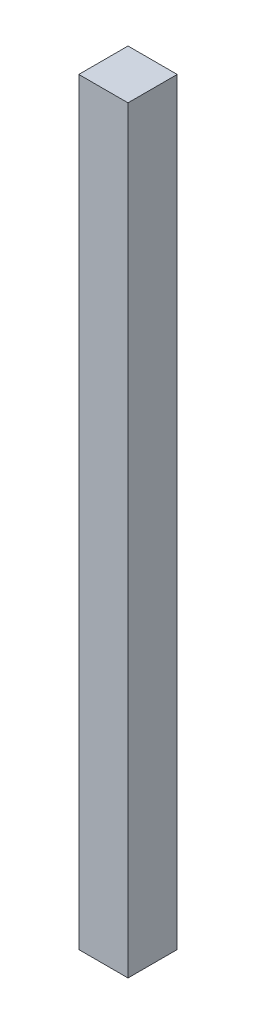
ISO-10303-21;
HEADER;
FILE_DESCRIPTION(('STEP AP214'),'2;1');
FILE_NAME('part.step','',(''),(''),'','','');
FILE_SCHEMA(('AUTOMOTIVE_DESIGN { 1 0 10303 214 1 1 1 1 }'));
ENDSEC;
DATA;
#1=APPLICATION_CONTEXT('core data for automotive mechanical design processes');
#2=APPLICATION_PROTOCOL_DEFINITION('international standard','automotive_design',2000,#1);
#3=PRODUCT_CONTEXT('',#1,'mechanical');
#4=PRODUCT('Part','Part','',(#3));
#5=PRODUCT_RELATED_PRODUCT_CATEGORY('part','',(#4));
#6=PRODUCT_DEFINITION_FORMATION('','',#4);
#7=PRODUCT_DEFINITION_CONTEXT('part definition',#1,'design');
#8=PRODUCT_DEFINITION('design','',#6,#7);
#9=PRODUCT_DEFINITION_SHAPE('','',#8);
#10=(LENGTH_UNIT() NAMED_UNIT(*) SI_UNIT(.MILLI.,.METRE.));
#11=(NAMED_UNIT(*) PLANE_ANGLE_UNIT() SI_UNIT($,.RADIAN.));
#12=(NAMED_UNIT(*) SI_UNIT($,.STERADIAN.) SOLID_ANGLE_UNIT());
#13=UNCERTAINTY_MEASURE_WITH_UNIT(LENGTH_MEASURE(1.E-05),#10,'distance_accuracy_value','');
#14=(GEOMETRIC_REPRESENTATION_CONTEXT(3) GLOBAL_UNCERTAINTY_ASSIGNED_CONTEXT((#13)) GLOBAL_UNIT_ASSIGNED_CONTEXT((#10,
#11,#12)) REPRESENTATION_CONTEXT('',''));
#15=CARTESIAN_POINT('',(0.,0.,0.));
#16=DIRECTION('',(0.,0.,1.));
#17=DIRECTION('',(1.,0.,0.));
#18=AXIS2_PLACEMENT_3D('',#15,#16,#17);
#19=CARTESIAN_POINT('',(-25.,770.,25.));
#20=DIRECTION('',(1.,0.,0.));
#21=DIRECTION('',(0.,0.,-1.));
#22=AXIS2_PLACEMENT_3D('',#19,#20,#21);
#23=PLANE('',#22);
#24=DIRECTION('',(0.,0.,1.));
#25=VECTOR('',#24,1.);
#26=CARTESIAN_POINT('',(-25.,0.,25.));
#27=LINE('',#26,#25);
#28=CARTESIAN_POINT('',(-25.,0.,-25.));
#29=VERTEX_POINT('',#28);
#30=CARTESIAN_POINT('',(-25.,0.,25.));
#31=VERTEX_POINT('',#30);
#32=EDGE_CURVE('E111',#29,#31,#27,.T.);
#33=ORIENTED_EDGE('',*,*,#32,.T.);
#34=DIRECTION('',(0.,-1.,0.));
#35=VECTOR('',#34,1.);
#36=CARTESIAN_POINT('',(-25.,770.,25.));
#37=LINE('',#36,#35);
#38=CARTESIAN_POINT('',(-25.,770.,25.));
#39=VERTEX_POINT('',#38);
#40=EDGE_CURVE('E11',#39,#31,#37,.T.);
#41=ORIENTED_EDGE('',*,*,#40,.F.);
#42=DIRECTION('',(0.,0.,1.));
#43=VECTOR('',#42,1.);
#44=CARTESIAN_POINT('',(-25.,770.,25.));
#45=LINE('',#44,#43);
#46=CARTESIAN_POINT('',(-25.,770.,-25.));
#47=VERTEX_POINT('',#46);
#48=EDGE_CURVE('E95',#47,#39,#45,.T.);
#49=ORIENTED_EDGE('',*,*,#48,.F.);
#50=DIRECTION('',(0.,-1.,0.));
#51=VECTOR('',#50,1.);
#52=CARTESIAN_POINT('',(-25.,770.,-25.));
#53=LINE('',#52,#51);
#54=EDGE_CURVE('E107',#47,#29,#53,.T.);
#55=ORIENTED_EDGE('',*,*,#54,.T.);
#56=EDGE_LOOP('',(#33,#41,#49,#55));
#57=FACE_BOUND('',#56,.T.);
#58=ADVANCED_FACE('F43',(#57),#23,.F.);
#59=CARTESIAN_POINT('',(25.,770.,25.));
#60=DIRECTION('',(0.,0.,-1.));
#61=DIRECTION('',(-1.,0.,0.));
#62=AXIS2_PLACEMENT_3D('',#59,#60,#61);
#63=PLANE('',#62);
#64=DIRECTION('',(1.,0.,0.));
#65=VECTOR('',#64,1.);
#66=CARTESIAN_POINT('',(25.,0.,25.));
#67=LINE('',#66,#65);
#68=CARTESIAN_POINT('',(25.,0.,25.));
#69=VERTEX_POINT('',#68);
#70=EDGE_CURVE('E100',#31,#69,#67,.T.);
#71=ORIENTED_EDGE('',*,*,#70,.T.);
#72=DIRECTION('',(0.,-1.,0.));
#73=VECTOR('',#72,1.);
#74=CARTESIAN_POINT('',(25.,770.,25.));
#75=LINE('',#74,#73);
#76=CARTESIAN_POINT('',(25.,770.,25.));
#77=VERTEX_POINT('',#76);
#78=EDGE_CURVE('E52',#77,#69,#75,.T.);
#79=ORIENTED_EDGE('',*,*,#78,.F.);
#80=DIRECTION('',(1.,0.,0.));
#81=VECTOR('',#80,1.);
#82=CARTESIAN_POINT('',(25.,770.,25.));
#83=LINE('',#82,#81);
#84=EDGE_CURVE('E90',#39,#77,#83,.T.);
#85=ORIENTED_EDGE('',*,*,#84,.F.);
#86=ORIENTED_EDGE('',*,*,#40,.T.);
#87=EDGE_LOOP('',(#71,#79,#85,#86));
#88=FACE_BOUND('',#87,.T.);
#89=ADVANCED_FACE('F99',(#88),#63,.F.);
#90=CARTESIAN_POINT('',(25.,770.,25.));
#91=DIRECTION('',(-1.,0.,0.));
#92=DIRECTION('',(0.,0.,1.));
#93=AXIS2_PLACEMENT_3D('',#90,#91,#92);
#94=PLANE('',#93);
#95=DIRECTION('',(0.,0.,-1.));
#96=VECTOR('',#95,1.);
#97=CARTESIAN_POINT('',(25.,0.,25.));
#98=LINE('',#97,#96);
#99=CARTESIAN_POINT('',(25.,0.,-25.));
#100=VERTEX_POINT('',#99);
#101=EDGE_CURVE('E77',#69,#100,#98,.T.);
#102=ORIENTED_EDGE('',*,*,#101,.T.);
#103=DIRECTION('',(0.,-1.,0.));
#104=VECTOR('',#103,1.);
#105=CARTESIAN_POINT('',(25.,770.,-25.));
#106=LINE('',#105,#104);
#107=CARTESIAN_POINT('',(25.,770.,-25.));
#108=VERTEX_POINT('',#107);
#109=EDGE_CURVE('E102',#108,#100,#106,.T.);
#110=ORIENTED_EDGE('',*,*,#109,.F.);
#111=DIRECTION('',(0.,0.,-1.));
#112=VECTOR('',#111,1.);
#113=CARTESIAN_POINT('',(25.,770.,25.));
#114=LINE('',#113,#112);
#115=EDGE_CURVE('E93',#77,#108,#114,.T.);
#116=ORIENTED_EDGE('',*,*,#115,.F.);
#117=ORIENTED_EDGE('',*,*,#78,.T.);
#118=EDGE_LOOP('',(#102,#110,#116,#117));
#119=FACE_BOUND('',#118,.T.);
#120=ADVANCED_FACE('F103',(#119),#94,.F.);
#121=CARTESIAN_POINT('',(25.,770.,-25.));
#122=DIRECTION('',(0.,0.,1.));
#123=DIRECTION('',(1.,0.,0.));
#124=AXIS2_PLACEMENT_3D('',#121,#122,#123);
#125=PLANE('',#124);
#126=DIRECTION('',(-1.,0.,0.));
#127=VECTOR('',#126,1.);
#128=CARTESIAN_POINT('',(25.,0.,-25.));
#129=LINE('',#128,#127);
#130=EDGE_CURVE('E83',#100,#29,#129,.T.);
#131=ORIENTED_EDGE('',*,*,#130,.T.);
#132=ORIENTED_EDGE('',*,*,#54,.F.);
#133=DIRECTION('',(-1.,0.,0.));
#134=VECTOR('',#133,1.);
#135=CARTESIAN_POINT('',(25.,770.,-25.));
#136=LINE('',#135,#134);
#137=EDGE_CURVE('E60',#108,#47,#136,.T.);
#138=ORIENTED_EDGE('',*,*,#137,.F.);
#139=ORIENTED_EDGE('',*,*,#109,.T.);
#140=EDGE_LOOP('',(#131,#132,#138,#139));
#141=FACE_BOUND('',#140,.T.);
#142=ADVANCED_FACE('F124',(#141),#125,.F.);
#143=CARTESIAN_POINT('',(0.,770.,0.));
#144=DIRECTION('',(0.,1.,0.));
#145=DIRECTION('',(0.,0.,1.));
#146=AXIS2_PLACEMENT_3D('',#143,#144,#145);
#147=PLANE('',#146);
#148=ORIENTED_EDGE('',*,*,#48,.T.);
#149=ORIENTED_EDGE('',*,*,#84,.T.);
#150=ORIENTED_EDGE('',*,*,#115,.T.);
#151=ORIENTED_EDGE('',*,*,#137,.T.);
#152=EDGE_LOOP('',(#148,#149,#150,#151));
#153=FACE_BOUND('',#152,.T.);
#154=ADVANCED_FACE('F91',(#153),#147,.T.);
#155=CARTESIAN_POINT('',(0.,0.,0.));
#156=DIRECTION('',(0.,1.,0.));
#157=DIRECTION('',(0.,0.,1.));
#158=AXIS2_PLACEMENT_3D('',#155,#156,#157);
#159=PLANE('',#158);
#160=ORIENTED_EDGE('',*,*,#32,.F.);
#161=ORIENTED_EDGE('',*,*,#130,.F.);
#162=ORIENTED_EDGE('',*,*,#101,.F.);
#163=ORIENTED_EDGE('',*,*,#70,.F.);
#164=EDGE_LOOP('',(#160,#161,#162,#163));
#165=FACE_BOUND('',#164,.T.);
#166=ADVANCED_FACE('F127',(#165),#159,.F.);
#167=CLOSED_SHELL('',(#58,#89,#120,#142,#154,#166));
#168=MANIFOLD_SOLID_BREP('B2',#167);
#169=ADVANCED_BREP_SHAPE_REPRESENTATION('',(#18,#168),#14);
#170=SHAPE_DEFINITION_REPRESENTATION(#9,#169);
ENDSEC;
END-ISO-10303-21;
